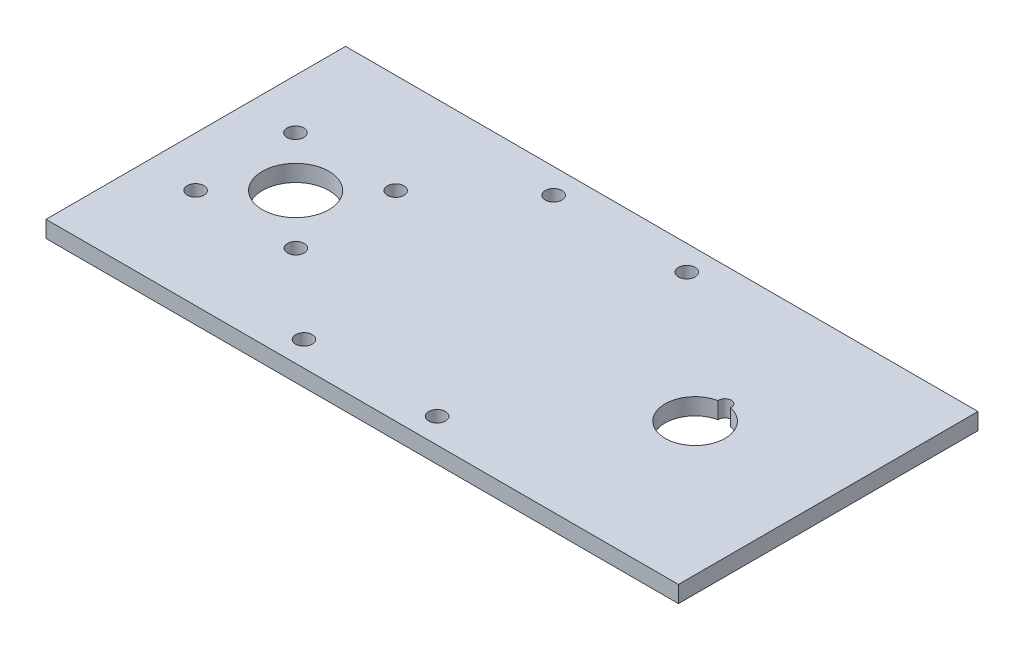
ISO-10303-21;
HEADER;
FILE_DESCRIPTION(('STEP AP214'),'2;1');
FILE_NAME('part.step','',(''),(''),'','','');
FILE_SCHEMA(('AUTOMOTIVE_DESIGN { 1 0 10303 214 1 1 1 1 }'));
ENDSEC;
DATA;
#1=APPLICATION_CONTEXT('core data for automotive mechanical design processes');
#2=APPLICATION_PROTOCOL_DEFINITION('international standard','automotive_design',2000,#1);
#3=PRODUCT_CONTEXT('',#1,'mechanical');
#4=PRODUCT('Part','Part','',(#3));
#5=PRODUCT_RELATED_PRODUCT_CATEGORY('part','',(#4));
#6=PRODUCT_DEFINITION_FORMATION('','',#4);
#7=PRODUCT_DEFINITION_CONTEXT('part definition',#1,'design');
#8=PRODUCT_DEFINITION('design','',#6,#7);
#9=PRODUCT_DEFINITION_SHAPE('','',#8);
#10=(LENGTH_UNIT() NAMED_UNIT(*) SI_UNIT(.MILLI.,.METRE.));
#11=(NAMED_UNIT(*) PLANE_ANGLE_UNIT() SI_UNIT($,.RADIAN.));
#12=(NAMED_UNIT(*) SI_UNIT($,.STERADIAN.) SOLID_ANGLE_UNIT());
#13=UNCERTAINTY_MEASURE_WITH_UNIT(LENGTH_MEASURE(1.E-05),#10,'distance_accuracy_value','');
#14=(GEOMETRIC_REPRESENTATION_CONTEXT(3) GLOBAL_UNCERTAINTY_ASSIGNED_CONTEXT((#13)) GLOBAL_UNIT_ASSIGNED_CONTEXT((#10,
#11,#12)) REPRESENTATION_CONTEXT('',''));
#15=CARTESIAN_POINT('',(0.,0.,0.));
#16=DIRECTION('',(0.,0.,1.));
#17=DIRECTION('',(1.,0.,0.));
#18=AXIS2_PLACEMENT_3D('',#15,#16,#17);
#19=CARTESIAN_POINT('',(0.,6.35,0.));
#20=DIRECTION('',(0.,-1.,0.));
#21=DIRECTION('',(0.,0.,-1.));
#22=AXIS2_PLACEMENT_3D('',#19,#20,#21);
#23=PLANE('',#22);
#24=CARTESIAN_POINT('',(57.2160313938328,6.35,-76.2));
#25=DIRECTION('',(0.,1.,0.));
#26=DIRECTION('',(0.,0.,1.));
#27=AXIS2_PLACEMENT_3D('',#24,#25,#26);
#28=CIRCLE('',#27,3.175);
#29=CARTESIAN_POINT('',(57.2160313938328,6.35,-73.025));
#30=VERTEX_POINT('',#29);
#31=EDGE_CURVE('E106',#30,#30,#28,.T.);
#32=ORIENTED_EDGE('',*,*,#31,.F.);
#33=EDGE_LOOP('',(#32));
#34=FACE_BOUND('',#33,.T.);
#35=CARTESIAN_POINT('',(57.2160313938328,6.35,-38.1));
#36=DIRECTION('',(0.,1.,0.));
#37=DIRECTION('',(0.,0.,1.));
#38=AXIS2_PLACEMENT_3D('',#35,#36,#37);
#39=CIRCLE('',#38,3.175);
#40=CARTESIAN_POINT('',(57.2160313938328,6.35,-34.925));
#41=VERTEX_POINT('',#40);
#42=EDGE_CURVE('E112',#41,#41,#39,.T.);
#43=ORIENTED_EDGE('',*,*,#42,.F.);
#44=EDGE_LOOP('',(#43));
#45=FACE_BOUND('',#44,.T.);
#46=CARTESIAN_POINT('',(18.9839686061672,6.35,-38.1));
#47=DIRECTION('',(0.,1.,0.));
#48=DIRECTION('',(0.,0.,1.));
#49=AXIS2_PLACEMENT_3D('',#46,#47,#48);
#50=CIRCLE('',#49,3.175);
#51=CARTESIAN_POINT('',(18.9839686061672,6.35,-34.925));
#52=VERTEX_POINT('',#51);
#53=EDGE_CURVE('E118',#52,#52,#50,.T.);
#54=ORIENTED_EDGE('',*,*,#53,.F.);
#55=EDGE_LOOP('',(#54));
#56=FACE_BOUND('',#55,.T.);
#57=CARTESIAN_POINT('',(18.9839686061672,6.35,-76.2));
#58=DIRECTION('',(0.,1.,0.));
#59=DIRECTION('',(0.,0.,1.));
#60=AXIS2_PLACEMENT_3D('',#57,#58,#59);
#61=CIRCLE('',#60,3.175);
#62=CARTESIAN_POINT('',(18.9839686061672,6.35,-73.025));
#63=VERTEX_POINT('',#62);
#64=EDGE_CURVE('E124',#63,#63,#61,.T.);
#65=ORIENTED_EDGE('',*,*,#64,.F.);
#66=EDGE_LOOP('',(#65));
#67=FACE_BOUND('',#66,.T.);
#68=CARTESIAN_POINT('',(88.9,6.35,-9.525));
#69=DIRECTION('',(0.,1.,0.));
#70=DIRECTION('',(0.,0.,1.));
#71=AXIS2_PLACEMENT_3D('',#68,#69,#70);
#72=CIRCLE('',#71,3.175);
#73=CARTESIAN_POINT('',(88.9,6.35,-6.35));
#74=VERTEX_POINT('',#73);
#75=EDGE_CURVE('E130',#74,#74,#72,.T.);
#76=ORIENTED_EDGE('',*,*,#75,.F.);
#77=EDGE_LOOP('',(#76));
#78=FACE_BOUND('',#77,.T.);
#79=CARTESIAN_POINT('',(139.7,6.35,-9.525));
#80=DIRECTION('',(0.,1.,0.));
#81=DIRECTION('',(0.,0.,1.));
#82=AXIS2_PLACEMENT_3D('',#79,#80,#81);
#83=CIRCLE('',#82,3.175);
#84=CARTESIAN_POINT('',(139.7,6.35,-6.35));
#85=VERTEX_POINT('',#84);
#86=EDGE_CURVE('E136',#85,#85,#83,.T.);
#87=ORIENTED_EDGE('',*,*,#86,.F.);
#88=EDGE_LOOP('',(#87));
#89=FACE_BOUND('',#88,.T.);
#90=CARTESIAN_POINT('',(139.7,6.35,-104.775));
#91=DIRECTION('',(0.,1.,0.));
#92=DIRECTION('',(0.,0.,1.));
#93=AXIS2_PLACEMENT_3D('',#90,#91,#92);
#94=CIRCLE('',#93,3.17499999999997);
#95=CARTESIAN_POINT('',(139.7,6.35,-101.6));
#96=VERTEX_POINT('',#95);
#97=EDGE_CURVE('E142',#96,#96,#94,.T.);
#98=ORIENTED_EDGE('',*,*,#97,.F.);
#99=EDGE_LOOP('',(#98));
#100=FACE_BOUND('',#99,.T.);
#101=CARTESIAN_POINT('',(88.9,6.35,-104.775));
#102=DIRECTION('',(0.,1.,0.));
#103=DIRECTION('',(0.,0.,1.));
#104=AXIS2_PLACEMENT_3D('',#101,#102,#103);
#105=CIRCLE('',#104,3.175);
#106=CARTESIAN_POINT('',(88.9,6.35,-101.6));
#107=VERTEX_POINT('',#106);
#108=EDGE_CURVE('E148',#107,#107,#105,.T.);
#109=ORIENTED_EDGE('',*,*,#108,.F.);
#110=EDGE_LOOP('',(#109));
#111=FACE_BOUND('',#110,.T.);
#112=CARTESIAN_POINT('',(38.1,6.35,-57.15));
#113=DIRECTION('',(0.,1.,0.));
#114=DIRECTION('',(0.,0.,1.));
#115=AXIS2_PLACEMENT_3D('',#112,#113,#114);
#116=CIRCLE('',#115,12.7);
#117=CARTESIAN_POINT('',(38.1,6.35,-44.45));
#118=VERTEX_POINT('',#117);
#119=EDGE_CURVE('E154',#118,#118,#116,.T.);
#120=ORIENTED_EDGE('',*,*,#119,.F.);
#121=EDGE_LOOP('',(#120));
#122=FACE_BOUND('',#121,.T.);
#123=DIRECTION('',(0.,0.,1.));
#124=VECTOR('',#123,1.);
#125=CARTESIAN_POINT('',(0.,6.35,0.));
#126=LINE('',#125,#124);
#127=CARTESIAN_POINT('',(0.,6.35,-114.3));
#128=VERTEX_POINT('',#127);
#129=CARTESIAN_POINT('',(0.,6.35,0.));
#130=VERTEX_POINT('',#129);
#131=EDGE_CURVE('E160',#128,#130,#126,.T.);
#132=ORIENTED_EDGE('',*,*,#131,.T.);
#133=DIRECTION('',(1.,0.,0.));
#134=VECTOR('',#133,1.);
#135=CARTESIAN_POINT('',(0.,6.35,0.));
#136=LINE('',#135,#134);
#137=CARTESIAN_POINT('',(241.3,6.35,0.));
#138=VERTEX_POINT('',#137);
#139=EDGE_CURVE('E163',#130,#138,#136,.T.);
#140=ORIENTED_EDGE('',*,*,#139,.T.);
#141=DIRECTION('',(0.,0.,-1.));
#142=VECTOR('',#141,1.);
#143=CARTESIAN_POINT('',(241.3,6.35,0.));
#144=LINE('',#143,#142);
#145=CARTESIAN_POINT('',(241.3,6.35,-114.3));
#146=VERTEX_POINT('',#145);
#147=EDGE_CURVE('E166',#138,#146,#144,.T.);
#148=ORIENTED_EDGE('',*,*,#147,.T.);
#149=DIRECTION('',(-1.,0.,0.));
#150=VECTOR('',#149,1.);
#151=CARTESIAN_POINT('',(0.,6.35,-114.3));
#152=LINE('',#151,#150);
#153=EDGE_CURVE('E168',#146,#128,#152,.T.);
#154=ORIENTED_EDGE('',*,*,#153,.T.);
#155=EDGE_LOOP('',(#132,#140,#148,#154));
#156=FACE_BOUND('',#155,.T.);
#157=CARTESIAN_POINT('',(190.5,6.35,-68.58));
#158=DIRECTION('',(0.,1.,0.));
#159=DIRECTION('',(0.,0.,1.));
#160=AXIS2_PLACEMENT_3D('',#157,#158,#159);
#161=CIRCLE('',#160,2.38125);
#162=CARTESIAN_POINT('',(192.868295655171,6.35,-68.331953125));
#163=VERTEX_POINT('',#162);
#164=CARTESIAN_POINT('',(188.131704344829,6.35,-68.331953125));
#165=VERTEX_POINT('',#164);
#166=EDGE_CURVE('E95',#163,#165,#161,.T.);
#167=ORIENTED_EDGE('',*,*,#166,.F.);
#168=CARTESIAN_POINT('',(190.5,6.35,-57.15));
#169=DIRECTION('',(0.,1.,0.));
#170=DIRECTION('',(0.,0.,1.));
#171=AXIS2_PLACEMENT_3D('',#168,#169,#170);
#172=CIRCLE('',#171,11.43);
#173=EDGE_CURVE('E89',#165,#163,#172,.T.);
#174=ORIENTED_EDGE('',*,*,#173,.F.);
#175=EDGE_LOOP('',(#167,#174));
#176=FACE_BOUND('',#175,.T.);
#177=ADVANCED_FACE('F37',(#34,#45,#56,#67,#78,#89,#100,#111,#122,#156,#176),#23,.F.);
#178=CARTESIAN_POINT('',(0.,0.,0.));
#179=DIRECTION('',(0.,-1.,0.));
#180=DIRECTION('',(0.,0.,-1.));
#181=AXIS2_PLACEMENT_3D('',#178,#179,#180);
#182=PLANE('',#181);
#183=CARTESIAN_POINT('',(57.2160313938328,0.,-38.1));
#184=DIRECTION('',(0.,1.,0.));
#185=DIRECTION('',(0.,0.,1.));
#186=AXIS2_PLACEMENT_3D('',#183,#184,#185);
#187=CIRCLE('',#186,3.175);
#188=CARTESIAN_POINT('',(57.2160313938328,0.,-34.925));
#189=VERTEX_POINT('',#188);
#190=EDGE_CURVE('E109',#189,#189,#187,.T.);
#191=ORIENTED_EDGE('',*,*,#190,.T.);
#192=EDGE_LOOP('',(#191));
#193=FACE_BOUND('',#192,.T.);
#194=CARTESIAN_POINT('',(18.9839686061672,0.,-76.2));
#195=DIRECTION('',(0.,1.,0.));
#196=DIRECTION('',(0.,0.,1.));
#197=AXIS2_PLACEMENT_3D('',#194,#195,#196);
#198=CIRCLE('',#197,3.175);
#199=CARTESIAN_POINT('',(18.9839686061672,0.,-73.025));
#200=VERTEX_POINT('',#199);
#201=EDGE_CURVE('E121',#200,#200,#198,.T.);
#202=ORIENTED_EDGE('',*,*,#201,.T.);
#203=EDGE_LOOP('',(#202));
#204=FACE_BOUND('',#203,.T.);
#205=CARTESIAN_POINT('',(139.7,0.,-9.525));
#206=DIRECTION('',(0.,1.,0.));
#207=DIRECTION('',(0.,0.,1.));
#208=AXIS2_PLACEMENT_3D('',#205,#206,#207);
#209=CIRCLE('',#208,3.175);
#210=CARTESIAN_POINT('',(139.7,0.,-6.35));
#211=VERTEX_POINT('',#210);
#212=EDGE_CURVE('E133',#211,#211,#209,.T.);
#213=ORIENTED_EDGE('',*,*,#212,.T.);
#214=EDGE_LOOP('',(#213));
#215=FACE_BOUND('',#214,.T.);
#216=CARTESIAN_POINT('',(88.9,0.,-104.775));
#217=DIRECTION('',(0.,1.,0.));
#218=DIRECTION('',(0.,0.,1.));
#219=AXIS2_PLACEMENT_3D('',#216,#217,#218);
#220=CIRCLE('',#219,3.175);
#221=CARTESIAN_POINT('',(88.9,0.,-101.6));
#222=VERTEX_POINT('',#221);
#223=EDGE_CURVE('E145',#222,#222,#220,.T.);
#224=ORIENTED_EDGE('',*,*,#223,.T.);
#225=EDGE_LOOP('',(#224));
#226=FACE_BOUND('',#225,.T.);
#227=DIRECTION('',(0.,0.,1.));
#228=VECTOR('',#227,1.);
#229=CARTESIAN_POINT('',(0.,0.,0.));
#230=LINE('',#229,#228);
#231=CARTESIAN_POINT('',(0.,0.,-114.3));
#232=VERTEX_POINT('',#231);
#233=CARTESIAN_POINT('',(0.,0.,0.));
#234=VERTEX_POINT('',#233);
#235=EDGE_CURVE('E157',#232,#234,#230,.T.);
#236=ORIENTED_EDGE('',*,*,#235,.F.);
#237=DIRECTION('',(-1.,0.,0.));
#238=VECTOR('',#237,1.);
#239=CARTESIAN_POINT('',(0.,0.,-114.3));
#240=LINE('',#239,#238);
#241=CARTESIAN_POINT('',(241.3,0.,-114.3));
#242=VERTEX_POINT('',#241);
#243=EDGE_CURVE('E164',#242,#232,#240,.T.);
#244=ORIENTED_EDGE('',*,*,#243,.F.);
#245=DIRECTION('',(0.,0.,-1.));
#246=VECTOR('',#245,1.);
#247=CARTESIAN_POINT('',(241.3,0.,0.));
#248=LINE('',#247,#246);
#249=CARTESIAN_POINT('',(241.3,0.,0.));
#250=VERTEX_POINT('',#249);
#251=EDGE_CURVE('E175',#250,#242,#248,.T.);
#252=ORIENTED_EDGE('',*,*,#251,.F.);
#253=DIRECTION('',(1.,0.,0.));
#254=VECTOR('',#253,1.);
#255=CARTESIAN_POINT('',(0.,0.,0.));
#256=LINE('',#255,#254);
#257=EDGE_CURVE('E173',#234,#250,#256,.T.);
#258=ORIENTED_EDGE('',*,*,#257,.F.);
#259=EDGE_LOOP('',(#236,#244,#252,#258));
#260=FACE_BOUND('',#259,.T.);
#261=CARTESIAN_POINT('',(38.1,0.,-57.15));
#262=DIRECTION('',(0.,1.,0.));
#263=DIRECTION('',(0.,0.,1.));
#264=AXIS2_PLACEMENT_3D('',#261,#262,#263);
#265=CIRCLE('',#264,12.7);
#266=CARTESIAN_POINT('',(38.1,0.,-44.45));
#267=VERTEX_POINT('',#266);
#268=EDGE_CURVE('E151',#267,#267,#265,.T.);
#269=ORIENTED_EDGE('',*,*,#268,.T.);
#270=EDGE_LOOP('',(#269));
#271=FACE_BOUND('',#270,.T.);
#272=CARTESIAN_POINT('',(139.7,0.,-104.775));
#273=DIRECTION('',(0.,1.,0.));
#274=DIRECTION('',(0.,0.,1.));
#275=AXIS2_PLACEMENT_3D('',#272,#273,#274);
#276=CIRCLE('',#275,3.17499999999997);
#277=CARTESIAN_POINT('',(139.7,0.,-101.6));
#278=VERTEX_POINT('',#277);
#279=EDGE_CURVE('E139',#278,#278,#276,.T.);
#280=ORIENTED_EDGE('',*,*,#279,.T.);
#281=EDGE_LOOP('',(#280));
#282=FACE_BOUND('',#281,.T.);
#283=CARTESIAN_POINT('',(88.9,0.,-9.525));
#284=DIRECTION('',(0.,1.,0.));
#285=DIRECTION('',(0.,0.,1.));
#286=AXIS2_PLACEMENT_3D('',#283,#284,#285);
#287=CIRCLE('',#286,3.175);
#288=CARTESIAN_POINT('',(88.9,0.,-6.35));
#289=VERTEX_POINT('',#288);
#290=EDGE_CURVE('E127',#289,#289,#287,.T.);
#291=ORIENTED_EDGE('',*,*,#290,.T.);
#292=EDGE_LOOP('',(#291));
#293=FACE_BOUND('',#292,.T.);
#294=CARTESIAN_POINT('',(18.9839686061672,0.,-38.1));
#295=DIRECTION('',(0.,1.,0.));
#296=DIRECTION('',(0.,0.,1.));
#297=AXIS2_PLACEMENT_3D('',#294,#295,#296);
#298=CIRCLE('',#297,3.175);
#299=CARTESIAN_POINT('',(18.9839686061672,0.,-34.925));
#300=VERTEX_POINT('',#299);
#301=EDGE_CURVE('E115',#300,#300,#298,.T.);
#302=ORIENTED_EDGE('',*,*,#301,.T.);
#303=EDGE_LOOP('',(#302));
#304=FACE_BOUND('',#303,.T.);
#305=CARTESIAN_POINT('',(57.2160313938328,0.,-76.2));
#306=DIRECTION('',(0.,1.,0.));
#307=DIRECTION('',(0.,0.,1.));
#308=AXIS2_PLACEMENT_3D('',#305,#306,#307);
#309=CIRCLE('',#308,3.175);
#310=CARTESIAN_POINT('',(57.2160313938328,0.,-73.025));
#311=VERTEX_POINT('',#310);
#312=EDGE_CURVE('E105',#311,#311,#309,.T.);
#313=ORIENTED_EDGE('',*,*,#312,.T.);
#314=EDGE_LOOP('',(#313));
#315=FACE_BOUND('',#314,.T.);
#316=CARTESIAN_POINT('',(190.5,0.,-57.15));
#317=DIRECTION('',(0.,1.,0.));
#318=DIRECTION('',(0.,0.,1.));
#319=AXIS2_PLACEMENT_3D('',#316,#317,#318);
#320=CIRCLE('',#319,11.43);
#321=CARTESIAN_POINT('',(188.131704344829,0.,-68.331953125));
#322=VERTEX_POINT('',#321);
#323=CARTESIAN_POINT('',(192.868295655171,0.,-68.331953125));
#324=VERTEX_POINT('',#323);
#325=EDGE_CURVE('E99',#322,#324,#320,.T.);
#326=ORIENTED_EDGE('',*,*,#325,.T.);
#327=CARTESIAN_POINT('',(190.5,0.,-68.58));
#328=DIRECTION('',(0.,1.,0.));
#329=DIRECTION('',(0.,0.,1.));
#330=AXIS2_PLACEMENT_3D('',#327,#328,#329);
#331=CIRCLE('',#330,2.38125);
#332=EDGE_CURVE('E59',#324,#322,#331,.T.);
#333=ORIENTED_EDGE('',*,*,#332,.T.);
#334=EDGE_LOOP('',(#326,#333));
#335=FACE_BOUND('',#334,.T.);
#336=ADVANCED_FACE('F193',(#193,#204,#215,#226,#260,#271,#282,#293,#304,#315,#335),#182,.T.);
#337=CARTESIAN_POINT('',(0.,6.35,0.));
#338=DIRECTION('',(1.,0.,0.));
#339=DIRECTION('',(0.,0.,-1.));
#340=AXIS2_PLACEMENT_3D('',#337,#338,#339);
#341=PLANE('',#340);
#342=ORIENTED_EDGE('',*,*,#235,.T.);
#343=DIRECTION('',(0.,-1.,0.));
#344=VECTOR('',#343,1.);
#345=CARTESIAN_POINT('',(0.,6.35,0.));
#346=LINE('',#345,#344);
#347=EDGE_CURVE('E11',#130,#234,#346,.T.);
#348=ORIENTED_EDGE('',*,*,#347,.F.);
#349=ORIENTED_EDGE('',*,*,#131,.F.);
#350=DIRECTION('',(0.,-1.,0.));
#351=VECTOR('',#350,1.);
#352=CARTESIAN_POINT('',(0.,6.35,-114.3));
#353=LINE('',#352,#351);
#354=EDGE_CURVE('E170',#128,#232,#353,.T.);
#355=ORIENTED_EDGE('',*,*,#354,.T.);
#356=EDGE_LOOP('',(#342,#348,#349,#355));
#357=FACE_BOUND('',#356,.T.);
#358=ADVANCED_FACE('F39',(#357),#341,.F.);
#359=CARTESIAN_POINT('',(0.,6.35,0.));
#360=DIRECTION('',(0.,0.,-1.));
#361=DIRECTION('',(-1.,0.,0.));
#362=AXIS2_PLACEMENT_3D('',#359,#360,#361);
#363=PLANE('',#362);
#364=ORIENTED_EDGE('',*,*,#257,.T.);
#365=DIRECTION('',(0.,-1.,0.));
#366=VECTOR('',#365,1.);
#367=CARTESIAN_POINT('',(241.3,6.35,0.));
#368=LINE('',#367,#366);
#369=EDGE_CURVE('E45',#138,#250,#368,.T.);
#370=ORIENTED_EDGE('',*,*,#369,.F.);
#371=ORIENTED_EDGE('',*,*,#139,.F.);
#372=ORIENTED_EDGE('',*,*,#347,.T.);
#373=EDGE_LOOP('',(#364,#370,#371,#372));
#374=FACE_BOUND('',#373,.T.);
#375=ADVANCED_FACE('F203',(#374),#363,.F.);
#376=CARTESIAN_POINT('',(241.3,6.35,0.));
#377=DIRECTION('',(-1.,0.,0.));
#378=DIRECTION('',(0.,0.,1.));
#379=AXIS2_PLACEMENT_3D('',#376,#377,#378);
#380=PLANE('',#379);
#381=ORIENTED_EDGE('',*,*,#251,.T.);
#382=DIRECTION('',(0.,-1.,0.));
#383=VECTOR('',#382,1.);
#384=CARTESIAN_POINT('',(241.3,6.35,-114.3));
#385=LINE('',#384,#383);
#386=EDGE_CURVE('E180',#146,#242,#385,.T.);
#387=ORIENTED_EDGE('',*,*,#386,.F.);
#388=ORIENTED_EDGE('',*,*,#147,.F.);
#389=ORIENTED_EDGE('',*,*,#369,.T.);
#390=EDGE_LOOP('',(#381,#387,#388,#389));
#391=FACE_BOUND('',#390,.T.);
#392=ADVANCED_FACE('F187',(#391),#380,.F.);
#393=CARTESIAN_POINT('',(0.,6.35,-114.3));
#394=DIRECTION('',(0.,0.,1.));
#395=DIRECTION('',(1.,0.,0.));
#396=AXIS2_PLACEMENT_3D('',#393,#394,#395);
#397=PLANE('',#396);
#398=ORIENTED_EDGE('',*,*,#243,.T.);
#399=ORIENTED_EDGE('',*,*,#354,.F.);
#400=ORIENTED_EDGE('',*,*,#153,.F.);
#401=ORIENTED_EDGE('',*,*,#386,.T.);
#402=EDGE_LOOP('',(#398,#399,#400,#401));
#403=FACE_BOUND('',#402,.T.);
#404=ADVANCED_FACE('F197',(#403),#397,.F.);
#405=CARTESIAN_POINT('',(38.1,6.35,-57.15));
#406=DIRECTION('',(0.,-1.,0.));
#407=DIRECTION('',(0.,0.,-1.));
#408=AXIS2_PLACEMENT_3D('',#405,#406,#407);
#409=CYLINDRICAL_SURFACE('',#408,12.7);
#410=ORIENTED_EDGE('',*,*,#119,.T.);
#411=EDGE_LOOP('',(#410));
#412=FACE_BOUND('',#411,.T.);
#413=ORIENTED_EDGE('',*,*,#268,.F.);
#414=EDGE_LOOP('',(#413));
#415=FACE_BOUND('',#414,.T.);
#416=ADVANCED_FACE('F221',(#412,#415),#409,.F.);
#417=CARTESIAN_POINT('',(88.9,6.35,-104.775));
#418=DIRECTION('',(0.,-1.,0.));
#419=DIRECTION('',(0.,0.,-1.));
#420=AXIS2_PLACEMENT_3D('',#417,#418,#419);
#421=CYLINDRICAL_SURFACE('',#420,3.175);
#422=ORIENTED_EDGE('',*,*,#108,.T.);
#423=EDGE_LOOP('',(#422));
#424=FACE_BOUND('',#423,.T.);
#425=ORIENTED_EDGE('',*,*,#223,.F.);
#426=EDGE_LOOP('',(#425));
#427=FACE_BOUND('',#426,.T.);
#428=ADVANCED_FACE('F228',(#424,#427),#421,.F.);
#429=CARTESIAN_POINT('',(139.7,6.35,-104.775));
#430=DIRECTION('',(0.,-1.,0.));
#431=DIRECTION('',(0.,0.,-1.));
#432=AXIS2_PLACEMENT_3D('',#429,#430,#431);
#433=CYLINDRICAL_SURFACE('',#432,3.17499999999997);
#434=ORIENTED_EDGE('',*,*,#97,.T.);
#435=EDGE_LOOP('',(#434));
#436=FACE_BOUND('',#435,.T.);
#437=ORIENTED_EDGE('',*,*,#279,.F.);
#438=EDGE_LOOP('',(#437));
#439=FACE_BOUND('',#438,.T.);
#440=ADVANCED_FACE('F233',(#436,#439),#433,.F.);
#441=CARTESIAN_POINT('',(139.7,6.35,-9.525));
#442=DIRECTION('',(0.,-1.,0.));
#443=DIRECTION('',(0.,0.,-1.));
#444=AXIS2_PLACEMENT_3D('',#441,#442,#443);
#445=CYLINDRICAL_SURFACE('',#444,3.175);
#446=ORIENTED_EDGE('',*,*,#86,.T.);
#447=EDGE_LOOP('',(#446));
#448=FACE_BOUND('',#447,.T.);
#449=ORIENTED_EDGE('',*,*,#212,.F.);
#450=EDGE_LOOP('',(#449));
#451=FACE_BOUND('',#450,.T.);
#452=ADVANCED_FACE('F273',(#448,#451),#445,.F.);
#453=CARTESIAN_POINT('',(88.9,6.35,-9.525));
#454=DIRECTION('',(0.,-1.,0.));
#455=DIRECTION('',(0.,0.,-1.));
#456=AXIS2_PLACEMENT_3D('',#453,#454,#455);
#457=CYLINDRICAL_SURFACE('',#456,3.175);
#458=ORIENTED_EDGE('',*,*,#75,.T.);
#459=EDGE_LOOP('',(#458));
#460=FACE_BOUND('',#459,.T.);
#461=ORIENTED_EDGE('',*,*,#290,.F.);
#462=EDGE_LOOP('',(#461));
#463=FACE_BOUND('',#462,.T.);
#464=ADVANCED_FACE('F269',(#460,#463),#457,.F.);
#465=CARTESIAN_POINT('',(18.9839686061672,6.35,-76.2));
#466=DIRECTION('',(0.,-1.,0.));
#467=DIRECTION('',(0.,0.,-1.));
#468=AXIS2_PLACEMENT_3D('',#465,#466,#467);
#469=CYLINDRICAL_SURFACE('',#468,3.175);
#470=ORIENTED_EDGE('',*,*,#64,.T.);
#471=EDGE_LOOP('',(#470));
#472=FACE_BOUND('',#471,.T.);
#473=ORIENTED_EDGE('',*,*,#201,.F.);
#474=EDGE_LOOP('',(#473));
#475=FACE_BOUND('',#474,.T.);
#476=ADVANCED_FACE('F265',(#472,#475),#469,.F.);
#477=CARTESIAN_POINT('',(18.9839686061672,6.35,-38.1));
#478=DIRECTION('',(0.,-1.,0.));
#479=DIRECTION('',(0.,0.,-1.));
#480=AXIS2_PLACEMENT_3D('',#477,#478,#479);
#481=CYLINDRICAL_SURFACE('',#480,3.175);
#482=ORIENTED_EDGE('',*,*,#53,.T.);
#483=EDGE_LOOP('',(#482));
#484=FACE_BOUND('',#483,.T.);
#485=ORIENTED_EDGE('',*,*,#301,.F.);
#486=EDGE_LOOP('',(#485));
#487=FACE_BOUND('',#486,.T.);
#488=ADVANCED_FACE('F258',(#484,#487),#481,.F.);
#489=CARTESIAN_POINT('',(57.2160313938328,6.35,-38.1));
#490=DIRECTION('',(0.,-1.,0.));
#491=DIRECTION('',(0.,0.,-1.));
#492=AXIS2_PLACEMENT_3D('',#489,#490,#491);
#493=CYLINDRICAL_SURFACE('',#492,3.175);
#494=ORIENTED_EDGE('',*,*,#42,.T.);
#495=EDGE_LOOP('',(#494));
#496=FACE_BOUND('',#495,.T.);
#497=ORIENTED_EDGE('',*,*,#190,.F.);
#498=EDGE_LOOP('',(#497));
#499=FACE_BOUND('',#498,.T.);
#500=ADVANCED_FACE('F250',(#496,#499),#493,.F.);
#501=CARTESIAN_POINT('',(57.2160313938328,6.35,-76.2));
#502=DIRECTION('',(0.,-1.,0.));
#503=DIRECTION('',(0.,0.,-1.));
#504=AXIS2_PLACEMENT_3D('',#501,#502,#503);
#505=CYLINDRICAL_SURFACE('',#504,3.175);
#506=ORIENTED_EDGE('',*,*,#31,.T.);
#507=EDGE_LOOP('',(#506));
#508=FACE_BOUND('',#507,.T.);
#509=ORIENTED_EDGE('',*,*,#312,.F.);
#510=EDGE_LOOP('',(#509));
#511=FACE_BOUND('',#510,.T.);
#512=ADVANCED_FACE('F248',(#508,#511),#505,.F.);
#513=CARTESIAN_POINT('',(190.5,6.35,-68.58));
#514=DIRECTION('',(0.,-1.,0.));
#515=DIRECTION('',(0.,0.,-1.));
#516=AXIS2_PLACEMENT_3D('',#513,#514,#515);
#517=CYLINDRICAL_SURFACE('',#516,2.38125);
#518=ORIENTED_EDGE('',*,*,#332,.F.);
#519=DIRECTION('',(0.,-1.,0.));
#520=VECTOR('',#519,1.);
#521=CARTESIAN_POINT('',(192.868295655171,6.35,-68.331953125));
#522=LINE('',#521,#520);
#523=EDGE_CURVE('E91',#163,#324,#522,.T.);
#524=ORIENTED_EDGE('',*,*,#523,.F.);
#525=ORIENTED_EDGE('',*,*,#166,.T.);
#526=DIRECTION('',(0.,-1.,0.));
#527=VECTOR('',#526,1.);
#528=CARTESIAN_POINT('',(188.131704344829,6.35,-68.331953125));
#529=LINE('',#528,#527);
#530=EDGE_CURVE('E52',#165,#322,#529,.T.);
#531=ORIENTED_EDGE('',*,*,#530,.T.);
#532=EDGE_LOOP('',(#518,#524,#525,#531));
#533=FACE_BOUND('',#532,.T.);
#534=ADVANCED_FACE('F97',(#533),#517,.F.);
#535=CARTESIAN_POINT('',(190.5,6.35,-57.15));
#536=DIRECTION('',(0.,-1.,0.));
#537=DIRECTION('',(0.,0.,-1.));
#538=AXIS2_PLACEMENT_3D('',#535,#536,#537);
#539=CYLINDRICAL_SURFACE('',#538,11.43);
#540=ORIENTED_EDGE('',*,*,#325,.F.);
#541=ORIENTED_EDGE('',*,*,#530,.F.);
#542=ORIENTED_EDGE('',*,*,#173,.T.);
#543=ORIENTED_EDGE('',*,*,#523,.T.);
#544=EDGE_LOOP('',(#540,#541,#542,#543));
#545=FACE_BOUND('',#544,.T.);
#546=ADVANCED_FACE('F90',(#545),#539,.F.);
#547=CLOSED_SHELL('',(#177,#336,#358,#375,#392,#404,#416,#428,#440,#452,#464,#476,#488,#500,
#512,#534,#546));
#548=MANIFOLD_SOLID_BREP('B2',#547);
#549=ADVANCED_BREP_SHAPE_REPRESENTATION('',(#18,#548),#14);
#550=SHAPE_DEFINITION_REPRESENTATION(#9,#549);
ENDSEC;
END-ISO-10303-21;
